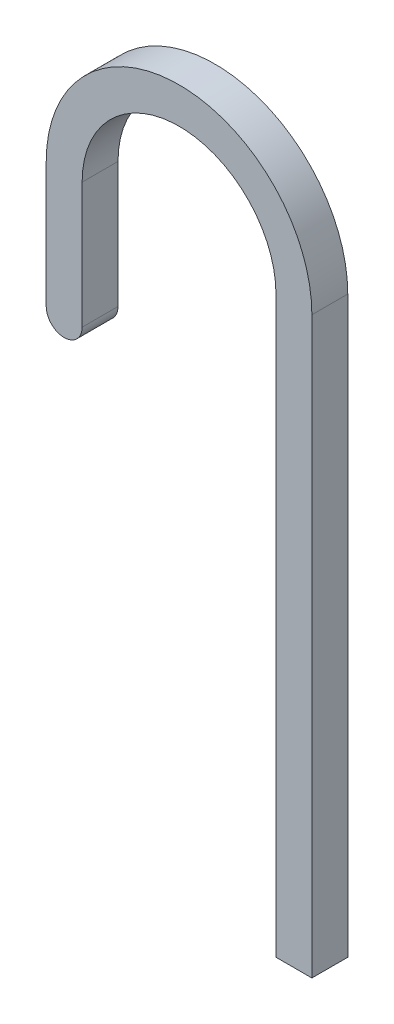
ISO-10303-21;
HEADER;
FILE_DESCRIPTION(('STEP AP214'),'2;1');
FILE_NAME('part.step','',(''),(''),'','','');
FILE_SCHEMA(('AUTOMOTIVE_DESIGN { 1 0 10303 214 1 1 1 1 }'));
ENDSEC;
DATA;
#1=APPLICATION_CONTEXT('core data for automotive mechanical design processes');
#2=APPLICATION_PROTOCOL_DEFINITION('international standard','automotive_design',2000,#1);
#3=PRODUCT_CONTEXT('',#1,'mechanical');
#4=PRODUCT('Part','Part','',(#3));
#5=PRODUCT_RELATED_PRODUCT_CATEGORY('part','',(#4));
#6=PRODUCT_DEFINITION_FORMATION('','',#4);
#7=PRODUCT_DEFINITION_CONTEXT('part definition',#1,'design');
#8=PRODUCT_DEFINITION('design','',#6,#7);
#9=PRODUCT_DEFINITION_SHAPE('','',#8);
#10=(LENGTH_UNIT() NAMED_UNIT(*) SI_UNIT(.MILLI.,.METRE.));
#11=(NAMED_UNIT(*) PLANE_ANGLE_UNIT() SI_UNIT($,.RADIAN.));
#12=(NAMED_UNIT(*) SI_UNIT($,.STERADIAN.) SOLID_ANGLE_UNIT());
#13=UNCERTAINTY_MEASURE_WITH_UNIT(LENGTH_MEASURE(1.E-05),#10,'distance_accuracy_value','');
#14=(GEOMETRIC_REPRESENTATION_CONTEXT(3) GLOBAL_UNCERTAINTY_ASSIGNED_CONTEXT((#13)) GLOBAL_UNIT_ASSIGNED_CONTEXT((#10,
#11,#12)) REPRESENTATION_CONTEXT('',''));
#15=CARTESIAN_POINT('',(0.,0.,0.));
#16=DIRECTION('',(0.,0.,1.));
#17=DIRECTION('',(1.,0.,0.));
#18=AXIS2_PLACEMENT_3D('',#15,#16,#17);
#19=CARTESIAN_POINT('',(-74.93,158.75,12.7));
#20=DIRECTION('',(0.,0.,-1.));
#21=DIRECTION('',(-1.,0.,0.));
#22=AXIS2_PLACEMENT_3D('',#19,#20,#21);
#23=CYLINDRICAL_SURFACE('',#22,6.35);
#24=DIRECTION('',(0.,0.,1.));
#25=VECTOR('',#24,1.);
#26=CARTESIAN_POINT('',(-74.93,152.4,12.7));
#27=LINE('',#26,#25);
#28=CARTESIAN_POINT('',(-74.93,152.4,0.));
#29=VERTEX_POINT('',#28);
#30=CARTESIAN_POINT('',(-74.93,152.4,12.7));
#31=VERTEX_POINT('',#30);
#32=EDGE_CURVE('E152',#29,#31,#27,.T.);
#33=ORIENTED_EDGE('',*,*,#32,.T.);
#34=CARTESIAN_POINT('',(-74.93,158.75,12.7));
#35=DIRECTION('',(0.,0.,1.));
#36=DIRECTION('',(1.,0.,0.));
#37=AXIS2_PLACEMENT_3D('',#34,#35,#36);
#38=CIRCLE('',#37,6.35);
#39=CARTESIAN_POINT('',(-81.28,158.75,12.7));
#40=VERTEX_POINT('',#39);
#41=EDGE_CURVE('E40',#40,#31,#38,.T.);
#42=ORIENTED_EDGE('',*,*,#41,.F.);
#43=DIRECTION('',(0.,0.,-1.));
#44=VECTOR('',#43,1.);
#45=CARTESIAN_POINT('',(-81.28,158.75,12.7));
#46=LINE('',#45,#44);
#47=CARTESIAN_POINT('',(-81.28,158.75,0.));
#48=VERTEX_POINT('',#47);
#49=EDGE_CURVE('E171',#48,#40,#46,.F.);
#50=ORIENTED_EDGE('',*,*,#49,.F.);
#51=CARTESIAN_POINT('',(-74.93,158.75,0.));
#52=DIRECTION('',(0.,0.,1.));
#53=DIRECTION('',(1.,0.,0.));
#54=AXIS2_PLACEMENT_3D('',#51,#52,#53);
#55=CIRCLE('',#54,6.35);
#56=EDGE_CURVE('E11',#29,#48,#55,.F.);
#57=ORIENTED_EDGE('',*,*,#56,.F.);
#58=EDGE_LOOP('',(#33,#42,#50,#57));
#59=FACE_BOUND('',#58,.T.);
#60=ADVANCED_FACE('F33',(#59),#23,.T.);
#61=CARTESIAN_POINT('',(-74.93,158.75,12.7));
#62=DIRECTION('',(0.,0.,1.));
#63=DIRECTION('',(1.,0.,0.));
#64=AXIS2_PLACEMENT_3D('',#61,#62,#63);
#65=CYLINDRICAL_SURFACE('',#64,6.35);
#66=ORIENTED_EDGE('',*,*,#32,.F.);
#67=CARTESIAN_POINT('',(-74.93,158.75,0.));
#68=DIRECTION('',(0.,0.,1.));
#69=DIRECTION('',(1.,0.,0.));
#70=AXIS2_PLACEMENT_3D('',#67,#68,#69);
#71=CIRCLE('',#70,6.35);
#72=CARTESIAN_POINT('',(-68.58,158.75,0.));
#73=VERTEX_POINT('',#72);
#74=EDGE_CURVE('E167',#73,#29,#71,.F.);
#75=ORIENTED_EDGE('',*,*,#74,.F.);
#76=DIRECTION('',(0.,0.,1.));
#77=VECTOR('',#76,1.);
#78=CARTESIAN_POINT('',(-68.58,158.75,12.7));
#79=LINE('',#78,#77);
#80=CARTESIAN_POINT('',(-68.58,158.75,12.7));
#81=VERTEX_POINT('',#80);
#82=EDGE_CURVE('E164',#81,#73,#79,.F.);
#83=ORIENTED_EDGE('',*,*,#82,.F.);
#84=CARTESIAN_POINT('',(-74.93,158.75,12.7));
#85=DIRECTION('',(0.,0.,1.));
#86=DIRECTION('',(1.,0.,0.));
#87=AXIS2_PLACEMENT_3D('',#84,#85,#86);
#88=CIRCLE('',#87,6.35);
#89=EDGE_CURVE('E169',#31,#81,#88,.T.);
#90=ORIENTED_EDGE('',*,*,#89,.F.);
#91=EDGE_LOOP('',(#66,#75,#83,#90));
#92=FACE_BOUND('',#91,.T.);
#93=ADVANCED_FACE('F177',(#92),#65,.T.);
#94=CARTESIAN_POINT('',(0.,0.,12.7));
#95=DIRECTION('',(-1.,0.,0.));
#96=DIRECTION('',(0.,0.,1.));
#97=AXIS2_PLACEMENT_3D('',#94,#95,#96);
#98=PLANE('',#97);
#99=DIRECTION('',(0.,1.,0.));
#100=VECTOR('',#99,1.);
#101=CARTESIAN_POINT('',(0.,0.,0.));
#102=LINE('',#101,#100);
#103=CARTESIAN_POINT('',(0.,0.,0.));
#104=VERTEX_POINT('',#103);
#105=CARTESIAN_POINT('',(0.,203.2,0.));
#106=VERTEX_POINT('',#105);
#107=EDGE_CURVE('E140',#104,#106,#102,.T.);
#108=ORIENTED_EDGE('',*,*,#107,.F.);
#109=DIRECTION('',(0.,0.,-1.));
#110=VECTOR('',#109,1.);
#111=CARTESIAN_POINT('',(0.,0.,12.7));
#112=LINE('',#111,#110);
#113=CARTESIAN_POINT('',(0.,0.,12.7));
#114=VERTEX_POINT('',#113);
#115=EDGE_CURVE('E125',#114,#104,#112,.T.);
#116=ORIENTED_EDGE('',*,*,#115,.F.);
#117=DIRECTION('',(0.,1.,0.));
#118=VECTOR('',#117,1.);
#119=CARTESIAN_POINT('',(0.,0.,12.7));
#120=LINE('',#119,#118);
#121=CARTESIAN_POINT('',(0.,203.2,12.7));
#122=VERTEX_POINT('',#121);
#123=EDGE_CURVE('E119',#114,#122,#120,.T.);
#124=ORIENTED_EDGE('',*,*,#123,.T.);
#125=DIRECTION('',(0.,0.,-1.));
#126=VECTOR('',#125,1.);
#127=CARTESIAN_POINT('',(0.,203.2,12.7));
#128=LINE('',#127,#126);
#129=EDGE_CURVE('E101',#122,#106,#128,.T.);
#130=ORIENTED_EDGE('',*,*,#129,.T.);
#131=EDGE_LOOP('',(#108,#116,#124,#130));
#132=FACE_BOUND('',#131,.T.);
#133=ADVANCED_FACE('F124',(#132),#98,.T.);
#134=CARTESIAN_POINT('',(0.,0.,12.7));
#135=DIRECTION('',(0.,1.,0.));
#136=DIRECTION('',(0.,0.,1.));
#137=AXIS2_PLACEMENT_3D('',#134,#135,#136);
#138=PLANE('',#137);
#139=DIRECTION('',(1.,0.,0.));
#140=VECTOR('',#139,1.);
#141=CARTESIAN_POINT('',(0.,0.,0.));
#142=LINE('',#141,#140);
#143=CARTESIAN_POINT('',(12.7,0.,0.));
#144=VERTEX_POINT('',#143);
#145=EDGE_CURVE('E127',#104,#144,#142,.T.);
#146=ORIENTED_EDGE('',*,*,#145,.T.);
#147=DIRECTION('',(0.,0.,-1.));
#148=VECTOR('',#147,1.);
#149=CARTESIAN_POINT('',(12.7,0.,12.7));
#150=LINE('',#149,#148);
#151=CARTESIAN_POINT('',(12.7,0.,12.7));
#152=VERTEX_POINT('',#151);
#153=EDGE_CURVE('E153',#152,#144,#150,.T.);
#154=ORIENTED_EDGE('',*,*,#153,.F.);
#155=DIRECTION('',(1.,0.,0.));
#156=VECTOR('',#155,1.);
#157=CARTESIAN_POINT('',(0.,0.,12.7));
#158=LINE('',#157,#156);
#159=EDGE_CURVE('E113',#114,#152,#158,.T.);
#160=ORIENTED_EDGE('',*,*,#159,.F.);
#161=ORIENTED_EDGE('',*,*,#115,.T.);
#162=EDGE_LOOP('',(#146,#154,#160,#161));
#163=FACE_BOUND('',#162,.T.);
#164=ADVANCED_FACE('F187',(#163),#138,.F.);
#165=CARTESIAN_POINT('',(12.7,0.,12.7));
#166=DIRECTION('',(-1.,0.,0.));
#167=DIRECTION('',(0.,0.,1.));
#168=AXIS2_PLACEMENT_3D('',#165,#166,#167);
#169=PLANE('',#168);
#170=DIRECTION('',(0.,1.,0.));
#171=VECTOR('',#170,1.);
#172=CARTESIAN_POINT('',(12.7,0.,0.));
#173=LINE('',#172,#171);
#174=CARTESIAN_POINT('',(12.7,203.2,0.));
#175=VERTEX_POINT('',#174);
#176=EDGE_CURVE('E129',#144,#175,#173,.T.);
#177=ORIENTED_EDGE('',*,*,#176,.T.);
#178=DIRECTION('',(0.,0.,-1.));
#179=VECTOR('',#178,1.);
#180=CARTESIAN_POINT('',(12.7,203.2,12.7));
#181=LINE('',#180,#179);
#182=CARTESIAN_POINT('',(12.7,203.2,12.7));
#183=VERTEX_POINT('',#182);
#184=EDGE_CURVE('E156',#183,#175,#181,.T.);
#185=ORIENTED_EDGE('',*,*,#184,.F.);
#186=DIRECTION('',(0.,1.,0.));
#187=VECTOR('',#186,1.);
#188=CARTESIAN_POINT('',(12.7,0.,12.7));
#189=LINE('',#188,#187);
#190=EDGE_CURVE('E137',#152,#183,#189,.T.);
#191=ORIENTED_EDGE('',*,*,#190,.F.);
#192=ORIENTED_EDGE('',*,*,#153,.T.);
#193=EDGE_LOOP('',(#177,#185,#191,#192));
#194=FACE_BOUND('',#193,.T.);
#195=ADVANCED_FACE('F190',(#194),#169,.F.);
#196=CARTESIAN_POINT('',(-34.29,203.2,12.7));
#197=DIRECTION('',(0.,0.,-1.));
#198=DIRECTION('',(-1.,0.,0.));
#199=AXIS2_PLACEMENT_3D('',#196,#197,#198);
#200=CYLINDRICAL_SURFACE('',#199,46.99);
#201=CARTESIAN_POINT('',(-34.29,203.2,0.));
#202=DIRECTION('',(0.,0.,1.));
#203=DIRECTION('',(1.,0.,0.));
#204=AXIS2_PLACEMENT_3D('',#201,#202,#203);
#205=CIRCLE('',#204,46.99);
#206=CARTESIAN_POINT('',(-81.28,203.2,0.));
#207=VERTEX_POINT('',#206);
#208=EDGE_CURVE('E148',#175,#207,#205,.T.);
#209=ORIENTED_EDGE('',*,*,#208,.T.);
#210=DIRECTION('',(0.,0.,-1.));
#211=VECTOR('',#210,1.);
#212=CARTESIAN_POINT('',(-81.28,203.2,12.7));
#213=LINE('',#212,#211);
#214=CARTESIAN_POINT('',(-81.28,203.2,12.7));
#215=VERTEX_POINT('',#214);
#216=EDGE_CURVE('E159',#215,#207,#213,.T.);
#217=ORIENTED_EDGE('',*,*,#216,.F.);
#218=CARTESIAN_POINT('',(-34.29,203.2,12.7));
#219=DIRECTION('',(0.,0.,1.));
#220=DIRECTION('',(1.,0.,0.));
#221=AXIS2_PLACEMENT_3D('',#218,#219,#220);
#222=CIRCLE('',#221,46.99);
#223=EDGE_CURVE('E135',#183,#215,#222,.T.);
#224=ORIENTED_EDGE('',*,*,#223,.F.);
#225=ORIENTED_EDGE('',*,*,#184,.T.);
#226=EDGE_LOOP('',(#209,#217,#224,#225));
#227=FACE_BOUND('',#226,.T.);
#228=ADVANCED_FACE('F195',(#227),#200,.T.);
#229=CARTESIAN_POINT('',(-81.28,203.2,12.7));
#230=DIRECTION('',(1.,0.,0.));
#231=DIRECTION('',(0.,0.,-1.));
#232=AXIS2_PLACEMENT_3D('',#229,#230,#231);
#233=PLANE('',#232);
#234=DIRECTION('',(0.,-1.,0.));
#235=VECTOR('',#234,1.);
#236=CARTESIAN_POINT('',(-81.28,203.2,0.));
#237=LINE('',#236,#235);
#238=EDGE_CURVE('E145',#207,#48,#237,.T.);
#239=ORIENTED_EDGE('',*,*,#238,.T.);
#240=ORIENTED_EDGE('',*,*,#49,.T.);
#241=DIRECTION('',(0.,-1.,0.));
#242=VECTOR('',#241,1.);
#243=CARTESIAN_POINT('',(-81.28,203.2,12.7));
#244=LINE('',#243,#242);
#245=EDGE_CURVE('E133',#215,#40,#244,.T.);
#246=ORIENTED_EDGE('',*,*,#245,.F.);
#247=ORIENTED_EDGE('',*,*,#216,.T.);
#248=EDGE_LOOP('',(#239,#240,#246,#247));
#249=FACE_BOUND('',#248,.T.);
#250=ADVANCED_FACE('F197',(#249),#233,.F.);
#251=CARTESIAN_POINT('',(-68.58,152.4,12.7));
#252=DIRECTION('',(-1.,0.,0.));
#253=DIRECTION('',(0.,0.,1.));
#254=AXIS2_PLACEMENT_3D('',#251,#252,#253);
#255=PLANE('',#254);
#256=DIRECTION('',(0.,1.,0.));
#257=VECTOR('',#256,1.);
#258=CARTESIAN_POINT('',(-68.58,152.4,12.7));
#259=LINE('',#258,#257);
#260=CARTESIAN_POINT('',(-68.58,203.2,12.7));
#261=VERTEX_POINT('',#260);
#262=EDGE_CURVE('E121',#81,#261,#259,.T.);
#263=ORIENTED_EDGE('',*,*,#262,.F.);
#264=ORIENTED_EDGE('',*,*,#82,.T.);
#265=DIRECTION('',(0.,1.,0.));
#266=VECTOR('',#265,1.);
#267=CARTESIAN_POINT('',(-68.58,152.4,0.));
#268=LINE('',#267,#266);
#269=CARTESIAN_POINT('',(-68.58,203.2,0.));
#270=VERTEX_POINT('',#269);
#271=EDGE_CURVE('E143',#73,#270,#268,.T.);
#272=ORIENTED_EDGE('',*,*,#271,.T.);
#273=DIRECTION('',(0.,0.,-1.));
#274=VECTOR('',#273,1.);
#275=CARTESIAN_POINT('',(-68.58,203.2,12.7));
#276=LINE('',#275,#274);
#277=EDGE_CURVE('E112',#261,#270,#276,.T.);
#278=ORIENTED_EDGE('',*,*,#277,.F.);
#279=EDGE_LOOP('',(#263,#264,#272,#278));
#280=FACE_BOUND('',#279,.T.);
#281=ADVANCED_FACE('F181',(#280),#255,.F.);
#282=CARTESIAN_POINT('',(-34.29,203.2,12.7));
#283=DIRECTION('',(0.,0.,-1.));
#284=DIRECTION('',(-1.,0.,0.));
#285=AXIS2_PLACEMENT_3D('',#282,#283,#284);
#286=CYLINDRICAL_SURFACE('',#285,34.29);
#287=CARTESIAN_POINT('',(-34.29,203.2,0.));
#288=DIRECTION('',(0.,0.,1.));
#289=DIRECTION('',(1.,0.,0.));
#290=AXIS2_PLACEMENT_3D('',#287,#288,#289);
#291=CIRCLE('',#290,34.29);
#292=EDGE_CURVE('E107',#106,#270,#291,.T.);
#293=ORIENTED_EDGE('',*,*,#292,.F.);
#294=ORIENTED_EDGE('',*,*,#129,.F.);
#295=CARTESIAN_POINT('',(-34.29,203.2,12.7));
#296=DIRECTION('',(0.,0.,1.));
#297=DIRECTION('',(1.,0.,0.));
#298=AXIS2_PLACEMENT_3D('',#295,#296,#297);
#299=CIRCLE('',#298,34.29);
#300=EDGE_CURVE('E105',#122,#261,#299,.T.);
#301=ORIENTED_EDGE('',*,*,#300,.T.);
#302=ORIENTED_EDGE('',*,*,#277,.T.);
#303=EDGE_LOOP('',(#293,#294,#301,#302));
#304=FACE_BOUND('',#303,.T.);
#305=ADVANCED_FACE('F103',(#304),#286,.F.);
#306=CARTESIAN_POINT('',(-34.29,203.2,12.7));
#307=DIRECTION('',(0.,0.,1.));
#308=DIRECTION('',(1.,0.,0.));
#309=AXIS2_PLACEMENT_3D('',#306,#307,#308);
#310=PLANE('',#309);
#311=ORIENTED_EDGE('',*,*,#245,.T.);
#312=ORIENTED_EDGE('',*,*,#41,.T.);
#313=ORIENTED_EDGE('',*,*,#89,.T.);
#314=ORIENTED_EDGE('',*,*,#262,.T.);
#315=ORIENTED_EDGE('',*,*,#300,.F.);
#316=ORIENTED_EDGE('',*,*,#123,.F.);
#317=ORIENTED_EDGE('',*,*,#159,.T.);
#318=ORIENTED_EDGE('',*,*,#190,.T.);
#319=ORIENTED_EDGE('',*,*,#223,.T.);
#320=EDGE_LOOP('',(#311,#312,#313,#314,#315,#316,#317,#318,#319));
#321=FACE_BOUND('',#320,.T.);
#322=ADVANCED_FACE('F118',(#321),#310,.T.);
#323=CARTESIAN_POINT('',(-34.29,203.2,0.));
#324=DIRECTION('',(0.,0.,1.));
#325=DIRECTION('',(1.,0.,0.));
#326=AXIS2_PLACEMENT_3D('',#323,#324,#325);
#327=PLANE('',#326);
#328=ORIENTED_EDGE('',*,*,#74,.T.);
#329=ORIENTED_EDGE('',*,*,#56,.T.);
#330=ORIENTED_EDGE('',*,*,#238,.F.);
#331=ORIENTED_EDGE('',*,*,#208,.F.);
#332=ORIENTED_EDGE('',*,*,#176,.F.);
#333=ORIENTED_EDGE('',*,*,#145,.F.);
#334=ORIENTED_EDGE('',*,*,#107,.T.);
#335=ORIENTED_EDGE('',*,*,#292,.T.);
#336=ORIENTED_EDGE('',*,*,#271,.F.);
#337=EDGE_LOOP('',(#328,#329,#330,#331,#332,#333,#334,#335,#336));
#338=FACE_BOUND('',#337,.T.);
#339=ADVANCED_FACE('F179',(#338),#327,.F.);
#340=CLOSED_SHELL('',(#60,#93,#133,#164,#195,#228,#250,#281,#305,#322,#339));
#341=MANIFOLD_SOLID_BREP('B2',#340);
#342=ADVANCED_BREP_SHAPE_REPRESENTATION('',(#18,#341),#14);
#343=SHAPE_DEFINITION_REPRESENTATION(#9,#342);
ENDSEC;
END-ISO-10303-21;
